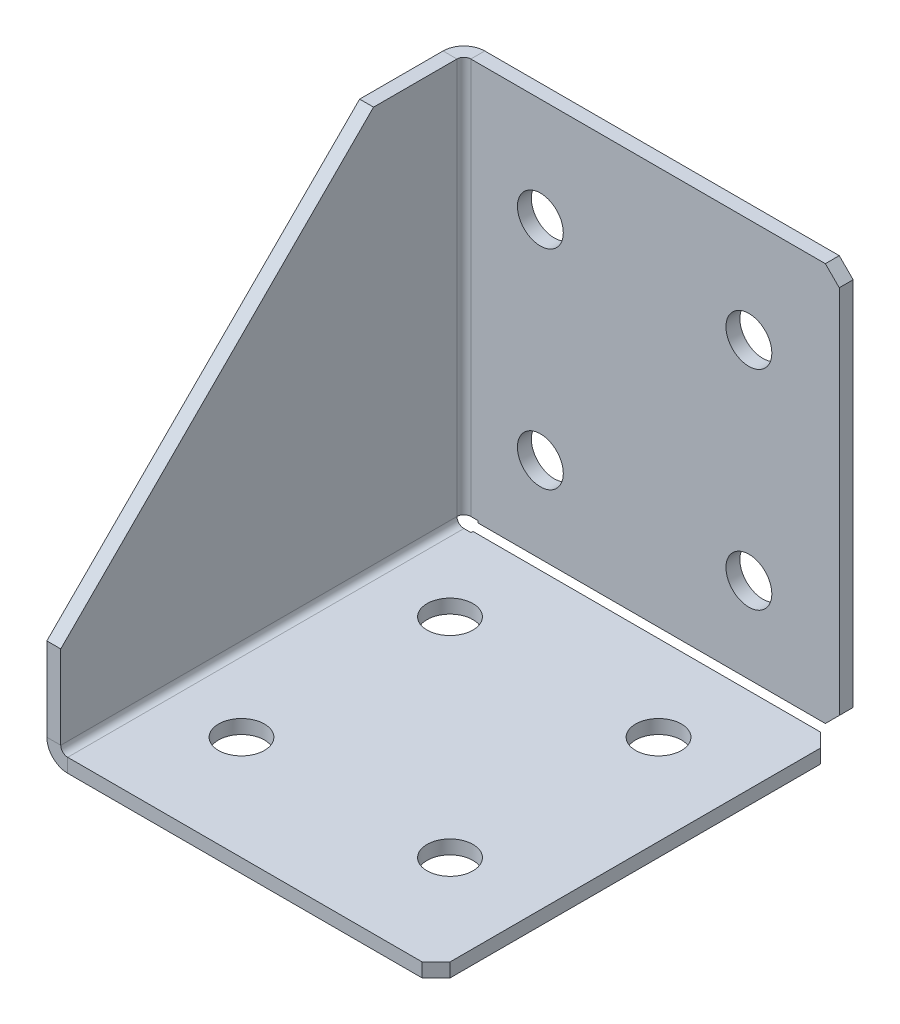
ISO-10303-21;
HEADER;
FILE_DESCRIPTION(('STEP AP214'),'2;1');
FILE_NAME('part.step','',(''),(''),'','','');
FILE_SCHEMA(('AUTOMOTIVE_DESIGN { 1 0 10303 214 1 1 1 1 }'));
ENDSEC;
DATA;
#1=APPLICATION_CONTEXT('core data for automotive mechanical design processes');
#2=APPLICATION_PROTOCOL_DEFINITION('international standard','automotive_design',2000,#1);
#3=PRODUCT_CONTEXT('',#1,'mechanical');
#4=PRODUCT('Part','Part','',(#3));
#5=PRODUCT_RELATED_PRODUCT_CATEGORY('part','',(#4));
#6=PRODUCT_DEFINITION_FORMATION('','',#4);
#7=PRODUCT_DEFINITION_CONTEXT('part definition',#1,'design');
#8=PRODUCT_DEFINITION('design','',#6,#7);
#9=PRODUCT_DEFINITION_SHAPE('','',#8);
#10=(LENGTH_UNIT() NAMED_UNIT(*) SI_UNIT(.MILLI.,.METRE.));
#11=(NAMED_UNIT(*) PLANE_ANGLE_UNIT() SI_UNIT($,.RADIAN.));
#12=(NAMED_UNIT(*) SI_UNIT($,.STERADIAN.) SOLID_ANGLE_UNIT());
#13=UNCERTAINTY_MEASURE_WITH_UNIT(LENGTH_MEASURE(1.E-05),#10,'distance_accuracy_value','');
#14=(GEOMETRIC_REPRESENTATION_CONTEXT(3) GLOBAL_UNCERTAINTY_ASSIGNED_CONTEXT((#13)) GLOBAL_UNIT_ASSIGNED_CONTEXT((#10,
#11,#12)) REPRESENTATION_CONTEXT('',''));
#15=CARTESIAN_POINT('',(0.,0.,0.));
#16=DIRECTION('',(0.,0.,1.));
#17=DIRECTION('',(1.,0.,0.));
#18=AXIS2_PLACEMENT_3D('',#15,#16,#17);
#19=CARTESIAN_POINT('',(-28.,2.,60.));
#20=DIRECTION('',(0.,-1.,0.));
#21=DIRECTION('',(0.,0.,-1.));
#22=AXIS2_PLACEMENT_3D('',#19,#20,#21);
#23=PLANE('',#22);
#24=DIRECTION('',(1.,0.,0.));
#25=VECTOR('',#24,1.);
#26=CARTESIAN_POINT('',(-28.,2.,60.));
#27=LINE('',#26,#25);
#28=CARTESIAN_POINT('',(-25.,2.,60.));
#29=VERTEX_POINT('',#28);
#30=CARTESIAN_POINT('',(26.,2.,60.));
#31=VERTEX_POINT('',#30);
#32=EDGE_CURVE('E348',#29,#31,#27,.T.);
#33=ORIENTED_EDGE('',*,*,#32,.T.);
#34=DIRECTION('',(-0.70710678118655,0.,0.707106781186545));
#35=VECTOR('',#34,1.);
#36=CARTESIAN_POINT('',(28.,2.,58.));
#37=LINE('',#36,#35);
#38=CARTESIAN_POINT('',(28.,2.,58.));
#39=VERTEX_POINT('',#38);
#40=EDGE_CURVE('E429',#31,#39,#37,.F.);
#41=ORIENTED_EDGE('',*,*,#40,.T.);
#42=DIRECTION('',(0.,0.,-1.));
#43=VECTOR('',#42,1.);
#44=CARTESIAN_POINT('',(28.,2.,60.));
#45=LINE('',#44,#43);
#46=CARTESIAN_POINT('',(28.,2.,4.70710678118655));
#47=VERTEX_POINT('',#46);
#48=EDGE_CURVE('E356',#39,#47,#45,.T.);
#49=ORIENTED_EDGE('',*,*,#48,.T.);
#50=DIRECTION('',(-0.707106781186545,0.,-0.70710678118655));
#51=VECTOR('',#50,1.);
#52=CARTESIAN_POINT('',(26.,2.,2.70710678118655));
#53=LINE('',#52,#51);
#54=CARTESIAN_POINT('',(26.,2.,2.70710678118655));
#55=VERTEX_POINT('',#54);
#56=EDGE_CURVE('E426',#47,#55,#53,.T.);
#57=ORIENTED_EDGE('',*,*,#56,.T.);
#58=DIRECTION('',(1.,0.,0.));
#59=VECTOR('',#58,1.);
#60=CARTESIAN_POINT('',(-28.,2.,2.70710678118655));
#61=LINE('',#60,#59);
#62=CARTESIAN_POINT('',(-23.989699,2.,2.70710678118655));
#63=VERTEX_POINT('',#62);
#64=EDGE_CURVE('E326',#63,#55,#61,.T.);
#65=ORIENTED_EDGE('',*,*,#64,.F.);
#66=DIRECTION('',(0.,0.,-1.));
#67=VECTOR('',#66,1.);
#68=CARTESIAN_POINT('',(-23.989699,2.,60.));
#69=LINE('',#68,#67);
#70=CARTESIAN_POINT('',(-23.989699,2.,2.99999999999998));
#71=VERTEX_POINT('',#70);
#72=EDGE_CURVE('E325',#71,#63,#69,.T.);
#73=ORIENTED_EDGE('',*,*,#72,.F.);
#74=DIRECTION('',(1.,0.,0.));
#75=VECTOR('',#74,1.);
#76=CARTESIAN_POINT('',(-28.,2.,2.99999999999998));
#77=LINE('',#76,#75);
#78=CARTESIAN_POINT('',(-25.,2.,2.99999999999998));
#79=VERTEX_POINT('',#78);
#80=EDGE_CURVE('E321',#71,#79,#77,.F.);
#81=ORIENTED_EDGE('',*,*,#80,.T.);
#82=DIRECTION('',(0.,0.,-1.));
#83=VECTOR('',#82,1.);
#84=CARTESIAN_POINT('',(-25.,2.,60.));
#85=LINE('',#84,#83);
#86=EDGE_CURVE('E307',#29,#79,#85,.T.);
#87=ORIENTED_EDGE('',*,*,#86,.F.);
#88=EDGE_LOOP('',(#33,#41,#49,#57,#65,#73,#81,#87));
#89=FACE_BOUND('',#88,.T.);
#90=CARTESIAN_POINT('',(15.,2.,15.));
#91=DIRECTION('',(0.,1.,0.));
#92=DIRECTION('',(0.,0.,1.));
#93=AXIS2_PLACEMENT_3D('',#90,#91,#92);
#94=CIRCLE('',#93,3.3);
#95=CARTESIAN_POINT('',(15.,2.,18.3));
#96=VERTEX_POINT('',#95);
#97=EDGE_CURVE('E663',#96,#96,#94,.T.);
#98=ORIENTED_EDGE('',*,*,#97,.F.);
#99=EDGE_LOOP('',(#98));
#100=FACE_BOUND('',#99,.T.);
#101=CARTESIAN_POINT('',(-15.,2.,45.));
#102=DIRECTION('',(0.,1.,0.));
#103=DIRECTION('',(0.,0.,1.));
#104=AXIS2_PLACEMENT_3D('',#101,#102,#103);
#105=CIRCLE('',#104,3.3);
#106=CARTESIAN_POINT('',(-15.,2.,48.3));
#107=VERTEX_POINT('',#106);
#108=EDGE_CURVE('E671',#107,#107,#105,.T.);
#109=ORIENTED_EDGE('',*,*,#108,.F.);
#110=EDGE_LOOP('',(#109));
#111=FACE_BOUND('',#110,.T.);
#112=CARTESIAN_POINT('',(15.,2.,45.));
#113=DIRECTION('',(0.,1.,0.));
#114=DIRECTION('',(0.,0.,1.));
#115=AXIS2_PLACEMENT_3D('',#112,#113,#114);
#116=CIRCLE('',#115,3.3);
#117=CARTESIAN_POINT('',(15.,2.,48.3));
#118=VERTEX_POINT('',#117);
#119=EDGE_CURVE('E679',#118,#118,#116,.T.);
#120=ORIENTED_EDGE('',*,*,#119,.F.);
#121=EDGE_LOOP('',(#120));
#122=FACE_BOUND('',#121,.T.);
#123=CARTESIAN_POINT('',(-15.,2.,15.));
#124=DIRECTION('',(0.,1.,0.));
#125=DIRECTION('',(0.,0.,1.));
#126=AXIS2_PLACEMENT_3D('',#123,#124,#125);
#127=CIRCLE('',#126,3.3);
#128=CARTESIAN_POINT('',(-15.,2.,18.3));
#129=VERTEX_POINT('',#128);
#130=EDGE_CURVE('E687',#129,#129,#127,.T.);
#131=ORIENTED_EDGE('',*,*,#130,.F.);
#132=EDGE_LOOP('',(#131));
#133=FACE_BOUND('',#132,.T.);
#134=ADVANCED_FACE('F50',(#89,#100,#111,#122,#133),#23,.F.);
#135=CARTESIAN_POINT('',(-28.,0.,2.));
#136=DIRECTION('',(0.,0.,-1.));
#137=DIRECTION('',(-1.,0.,0.));
#138=AXIS2_PLACEMENT_3D('',#135,#136,#137);
#139=PLANE('',#138);
#140=DIRECTION('',(-1.,0.,0.));
#141=VECTOR('',#140,1.);
#142=CARTESIAN_POINT('',(-28.,2.70710678118655,2.));
#143=LINE('',#142,#141);
#144=CARTESIAN_POINT('',(26.,2.70710678118655,2.));
#145=VERTEX_POINT('',#144);
#146=CARTESIAN_POINT('',(-23.989699,2.70710678118655,2.));
#147=VERTEX_POINT('',#146);
#148=EDGE_CURVE('E322',#145,#147,#143,.T.);
#149=ORIENTED_EDGE('',*,*,#148,.F.);
#150=DIRECTION('',(0.70710678118655,0.707106781186545,0.));
#151=VECTOR('',#150,1.);
#152=CARTESIAN_POINT('',(28.,4.70710678118655,2.));
#153=LINE('',#152,#151);
#154=CARTESIAN_POINT('',(28.,4.70710678118655,2.));
#155=VERTEX_POINT('',#154);
#156=EDGE_CURVE('E60',#145,#155,#153,.T.);
#157=ORIENTED_EDGE('',*,*,#156,.T.);
#158=DIRECTION('',(0.,1.,0.));
#159=VECTOR('',#158,1.);
#160=CARTESIAN_POINT('',(28.,0.,2.));
#161=LINE('',#160,#159);
#162=CARTESIAN_POINT('',(28.,58.,2.));
#163=VERTEX_POINT('',#162);
#164=EDGE_CURVE('E327',#155,#163,#161,.T.);
#165=ORIENTED_EDGE('',*,*,#164,.T.);
#166=DIRECTION('',(-0.707106781186545,0.70710678118655,0.));
#167=VECTOR('',#166,1.);
#168=CARTESIAN_POINT('',(26.,60.,2.));
#169=LINE('',#168,#167);
#170=CARTESIAN_POINT('',(26.,60.,2.));
#171=VERTEX_POINT('',#170);
#172=EDGE_CURVE('E67',#163,#171,#169,.T.);
#173=ORIENTED_EDGE('',*,*,#172,.T.);
#174=DIRECTION('',(-1.,0.,0.));
#175=VECTOR('',#174,1.);
#176=CARTESIAN_POINT('',(-28.,60.,2.));
#177=LINE('',#176,#175);
#178=CARTESIAN_POINT('',(-25.,60.,2.));
#179=VERTEX_POINT('',#178);
#180=EDGE_CURVE('E330',#179,#171,#177,.F.);
#181=ORIENTED_EDGE('',*,*,#180,.F.);
#182=DIRECTION('',(0.,1.,0.));
#183=VECTOR('',#182,1.);
#184=CARTESIAN_POINT('',(-25.,0.,2.));
#185=LINE('',#184,#183);
#186=CARTESIAN_POINT('',(-25.,2.99999999999998,2.));
#187=VERTEX_POINT('',#186);
#188=EDGE_CURVE('E298',#187,#179,#185,.T.);
#189=ORIENTED_EDGE('',*,*,#188,.F.);
#190=DIRECTION('',(-1.,0.,0.));
#191=VECTOR('',#190,1.);
#192=CARTESIAN_POINT('',(-28.,2.99999999999998,2.));
#193=LINE('',#192,#191);
#194=CARTESIAN_POINT('',(-23.989699,2.99999999999998,2.));
#195=VERTEX_POINT('',#194);
#196=EDGE_CURVE('E303',#187,#195,#193,.F.);
#197=ORIENTED_EDGE('',*,*,#196,.T.);
#198=DIRECTION('',(0.,1.,0.));
#199=VECTOR('',#198,1.);
#200=CARTESIAN_POINT('',(-23.989699,0.,2.));
#201=LINE('',#200,#199);
#202=EDGE_CURVE('E317',#147,#195,#201,.T.);
#203=ORIENTED_EDGE('',*,*,#202,.F.);
#204=EDGE_LOOP('',(#149,#157,#165,#173,#181,#189,#197,#203));
#205=FACE_BOUND('',#204,.T.);
#206=CARTESIAN_POINT('',(15.,15.,2.));
#207=DIRECTION('',(0.,0.,1.));
#208=DIRECTION('',(1.,0.,0.));
#209=AXIS2_PLACEMENT_3D('',#206,#207,#208);
#210=CIRCLE('',#209,3.3);
#211=CARTESIAN_POINT('',(18.3,15.,2.));
#212=VERTEX_POINT('',#211);
#213=EDGE_CURVE('E631',#212,#212,#210,.T.);
#214=ORIENTED_EDGE('',*,*,#213,.F.);
#215=EDGE_LOOP('',(#214));
#216=FACE_BOUND('',#215,.T.);
#217=CARTESIAN_POINT('',(-15.,45.,2.));
#218=DIRECTION('',(0.,0.,1.));
#219=DIRECTION('',(1.,0.,0.));
#220=AXIS2_PLACEMENT_3D('',#217,#218,#219);
#221=CIRCLE('',#220,3.3);
#222=CARTESIAN_POINT('',(-11.7,45.,2.));
#223=VERTEX_POINT('',#222);
#224=EDGE_CURVE('E639',#223,#223,#221,.T.);
#225=ORIENTED_EDGE('',*,*,#224,.F.);
#226=EDGE_LOOP('',(#225));
#227=FACE_BOUND('',#226,.T.);
#228=CARTESIAN_POINT('',(15.,45.,2.));
#229=DIRECTION('',(0.,0.,1.));
#230=DIRECTION('',(1.,0.,0.));
#231=AXIS2_PLACEMENT_3D('',#228,#229,#230);
#232=CIRCLE('',#231,3.3);
#233=CARTESIAN_POINT('',(18.3,45.,2.));
#234=VERTEX_POINT('',#233);
#235=EDGE_CURVE('E647',#234,#234,#232,.T.);
#236=ORIENTED_EDGE('',*,*,#235,.F.);
#237=EDGE_LOOP('',(#236));
#238=FACE_BOUND('',#237,.T.);
#239=CARTESIAN_POINT('',(-15.,15.,2.));
#240=DIRECTION('',(0.,0.,1.));
#241=DIRECTION('',(1.,0.,0.));
#242=AXIS2_PLACEMENT_3D('',#239,#240,#241);
#243=CIRCLE('',#242,3.3);
#244=CARTESIAN_POINT('',(-11.7,15.,2.));
#245=VERTEX_POINT('',#244);
#246=EDGE_CURVE('E655',#245,#245,#243,.T.);
#247=ORIENTED_EDGE('',*,*,#246,.F.);
#248=EDGE_LOOP('',(#247));
#249=FACE_BOUND('',#248,.T.);
#250=ADVANCED_FACE('F457',(#205,#216,#227,#238,#249),#139,.F.);
#251=CARTESIAN_POINT('',(-25.,3.,2.99999999999998));
#252=DIRECTION('',(0.,0.,-1.));
#253=DIRECTION('',(-1.,0.,0.));
#254=AXIS2_PLACEMENT_3D('',#251,#252,#253);
#255=PLANE('',#254);
#256=DIRECTION('',(-1.,0.,0.));
#257=VECTOR('',#256,1.);
#258=CARTESIAN_POINT('',(-28.,2.99999999999998,2.99999999999998));
#259=LINE('',#258,#257);
#260=CARTESIAN_POINT('',(-26.,2.99999999999998,2.99999999999999));
#261=VERTEX_POINT('',#260);
#262=CARTESIAN_POINT('',(-28.,2.99999999999998,2.99999999999998));
#263=VERTEX_POINT('',#262);
#264=EDGE_CURVE('E405',#261,#263,#259,.T.);
#265=ORIENTED_EDGE('',*,*,#264,.F.);
#266=CARTESIAN_POINT('',(-25.,3.,2.99999999999998));
#267=DIRECTION('',(0.,0.,1.));
#268=DIRECTION('',(1.,0.,0.));
#269=AXIS2_PLACEMENT_3D('',#266,#267,#268);
#270=CIRCLE('',#269,1.);
#271=EDGE_CURVE('E352',#261,#79,#270,.T.);
#272=ORIENTED_EDGE('',*,*,#271,.T.);
#273=DIRECTION('',(0.,-1.,0.));
#274=VECTOR('',#273,1.);
#275=CARTESIAN_POINT('',(-25.,0.,2.99999999999998));
#276=LINE('',#275,#274);
#277=CARTESIAN_POINT('',(-25.,0.,2.99999999999998));
#278=VERTEX_POINT('',#277);
#279=EDGE_CURVE('E402',#79,#278,#276,.T.);
#280=ORIENTED_EDGE('',*,*,#279,.T.);
#281=CARTESIAN_POINT('',(-25.,3.,2.99999999999998));
#282=DIRECTION('',(0.,0.,1.));
#283=DIRECTION('',(1.,0.,0.));
#284=AXIS2_PLACEMENT_3D('',#281,#282,#283);
#285=CIRCLE('',#284,3.);
#286=EDGE_CURVE('E290',#263,#278,#285,.T.);
#287=ORIENTED_EDGE('',*,*,#286,.F.);
#288=EDGE_LOOP('',(#265,#272,#280,#287));
#289=FACE_BOUND('',#288,.T.);
#290=ADVANCED_FACE('F488',(#289),#255,.T.);
#291=CARTESIAN_POINT('',(-28.,0.,2.99999999999998));
#292=DIRECTION('',(0.,0.,1.));
#293=DIRECTION('',(-1.,0.,0.));
#294=AXIS2_PLACEMENT_3D('',#291,#292,#293);
#295=PLANE('',#294);
#296=ORIENTED_EDGE('',*,*,#279,.F.);
#297=ORIENTED_EDGE('',*,*,#80,.F.);
#298=DIRECTION('',(0.,-1.,0.));
#299=VECTOR('',#298,1.);
#300=CARTESIAN_POINT('',(-23.989699,0.,2.99999999999998));
#301=LINE('',#300,#299);
#302=CARTESIAN_POINT('',(-23.989699,0.,2.99999999999998));
#303=VERTEX_POINT('',#302);
#304=EDGE_CURVE('E399',#71,#303,#301,.T.);
#305=ORIENTED_EDGE('',*,*,#304,.T.);
#306=DIRECTION('',(-1.,0.,0.));
#307=VECTOR('',#306,1.);
#308=CARTESIAN_POINT('',(-28.,0.,2.99999999999998));
#309=LINE('',#308,#307);
#310=EDGE_CURVE('E254',#303,#278,#309,.T.);
#311=ORIENTED_EDGE('',*,*,#310,.T.);
#312=EDGE_LOOP('',(#296,#297,#305,#311));
#313=FACE_BOUND('',#312,.T.);
#314=ADVANCED_FACE('F574',(#313),#295,.F.);
#315=CARTESIAN_POINT('',(-23.989699,0.,60.));
#316=DIRECTION('',(-1.,0.,0.));
#317=DIRECTION('',(0.,0.,-1.));
#318=AXIS2_PLACEMENT_3D('',#315,#316,#317);
#319=PLANE('',#318);
#320=ORIENTED_EDGE('',*,*,#304,.F.);
#321=ORIENTED_EDGE('',*,*,#72,.T.);
#322=DIRECTION('',(0.,-1.,0.));
#323=VECTOR('',#322,1.);
#324=CARTESIAN_POINT('',(-23.989699,0.,2.70710678118655));
#325=LINE('',#324,#323);
#326=CARTESIAN_POINT('',(-23.989699,0.,2.70710678118655));
#327=VERTEX_POINT('',#326);
#328=EDGE_CURVE('E396',#63,#327,#325,.T.);
#329=ORIENTED_EDGE('',*,*,#328,.T.);
#330=DIRECTION('',(0.,0.,-1.));
#331=VECTOR('',#330,1.);
#332=CARTESIAN_POINT('',(-23.989699,0.,60.));
#333=LINE('',#332,#331);
#334=EDGE_CURVE('E250',#303,#327,#333,.T.);
#335=ORIENTED_EDGE('',*,*,#334,.F.);
#336=EDGE_LOOP('',(#320,#321,#329,#335));
#337=FACE_BOUND('',#336,.T.);
#338=ADVANCED_FACE('F570',(#337),#319,.T.);
#339=CARTESIAN_POINT('',(-28.,0.,2.70710678118655));
#340=DIRECTION('',(0.,0.,-1.));
#341=DIRECTION('',(1.,0.,0.));
#342=AXIS2_PLACEMENT_3D('',#339,#340,#341);
#343=PLANE('',#342);
#344=ORIENTED_EDGE('',*,*,#64,.T.);
#345=DIRECTION('',(0.,-1.,0.));
#346=VECTOR('',#345,1.);
#347=CARTESIAN_POINT('',(26.,0.,2.70710678118655));
#348=LINE('',#347,#346);
#349=CARTESIAN_POINT('',(26.,0.,2.70710678118655));
#350=VERTEX_POINT('',#349);
#351=EDGE_CURVE('E432',#55,#350,#348,.T.);
#352=ORIENTED_EDGE('',*,*,#351,.T.);
#353=DIRECTION('',(1.,0.,0.));
#354=VECTOR('',#353,1.);
#355=CARTESIAN_POINT('',(-28.,0.,2.70710678118655));
#356=LINE('',#355,#354);
#357=EDGE_CURVE('E243',#327,#350,#356,.T.);
#358=ORIENTED_EDGE('',*,*,#357,.F.);
#359=ORIENTED_EDGE('',*,*,#328,.F.);
#360=EDGE_LOOP('',(#344,#352,#358,#359));
#361=FACE_BOUND('',#360,.T.);
#362=ADVANCED_FACE('F566',(#361),#343,.T.);
#363=CARTESIAN_POINT('',(28.,0.,60.));
#364=DIRECTION('',(-1.,0.,0.));
#365=DIRECTION('',(0.,0.,-1.));
#366=AXIS2_PLACEMENT_3D('',#363,#364,#365);
#367=PLANE('',#366);
#368=ORIENTED_EDGE('',*,*,#48,.F.);
#369=DIRECTION('',(0.,1.,0.));
#370=VECTOR('',#369,1.);
#371=CARTESIAN_POINT('',(28.,0.,58.));
#372=LINE('',#371,#370);
#373=CARTESIAN_POINT('',(28.,0.,58.));
#374=VERTEX_POINT('',#373);
#375=EDGE_CURVE('E413',#39,#374,#372,.F.);
#376=ORIENTED_EDGE('',*,*,#375,.T.);
#377=DIRECTION('',(0.,0.,-1.));
#378=VECTOR('',#377,1.);
#379=CARTESIAN_POINT('',(28.,0.,60.));
#380=LINE('',#379,#378);
#381=CARTESIAN_POINT('',(28.,0.,4.70710678118655));
#382=VERTEX_POINT('',#381);
#383=EDGE_CURVE('E283',#374,#382,#380,.T.);
#384=ORIENTED_EDGE('',*,*,#383,.T.);
#385=DIRECTION('',(0.,-1.,0.));
#386=VECTOR('',#385,1.);
#387=CARTESIAN_POINT('',(28.,0.,4.70710678118655));
#388=LINE('',#387,#386);
#389=EDGE_CURVE('E408',#382,#47,#388,.F.);
#390=ORIENTED_EDGE('',*,*,#389,.T.);
#391=EDGE_LOOP('',(#368,#376,#384,#390));
#392=FACE_BOUND('',#391,.T.);
#393=ADVANCED_FACE('F562',(#392),#367,.F.);
#394=CARTESIAN_POINT('',(-28.,0.,60.));
#395=DIRECTION('',(0.,0.,-1.));
#396=DIRECTION('',(1.,0.,0.));
#397=AXIS2_PLACEMENT_3D('',#394,#395,#396);
#398=PLANE('',#397);
#399=DIRECTION('',(1.,0.,0.));
#400=VECTOR('',#399,1.);
#401=CARTESIAN_POINT('',(-28.,0.,60.));
#402=LINE('',#401,#400);
#403=CARTESIAN_POINT('',(-25.,0.,60.));
#404=VERTEX_POINT('',#403);
#405=CARTESIAN_POINT('',(26.,0.,60.));
#406=VERTEX_POINT('',#405);
#407=EDGE_CURVE('E223',#404,#406,#402,.T.);
#408=ORIENTED_EDGE('',*,*,#407,.T.);
#409=DIRECTION('',(0.,-1.,0.));
#410=VECTOR('',#409,1.);
#411=CARTESIAN_POINT('',(26.,0.,60.));
#412=LINE('',#411,#410);
#413=EDGE_CURVE('E423',#406,#31,#412,.F.);
#414=ORIENTED_EDGE('',*,*,#413,.T.);
#415=ORIENTED_EDGE('',*,*,#32,.F.);
#416=DIRECTION('',(0.,-1.,0.));
#417=VECTOR('',#416,1.);
#418=CARTESIAN_POINT('',(-25.,0.,60.));
#419=LINE('',#418,#417);
#420=EDGE_CURVE('E393',#29,#404,#419,.T.);
#421=ORIENTED_EDGE('',*,*,#420,.T.);
#422=EDGE_LOOP('',(#408,#414,#415,#421));
#423=FACE_BOUND('',#422,.T.);
#424=ADVANCED_FACE('F559',(#423),#398,.F.);
#425=CARTESIAN_POINT('',(-25.,3.,60.));
#426=DIRECTION('',(0.,0.,-1.));
#427=DIRECTION('',(-1.,0.,0.));
#428=AXIS2_PLACEMENT_3D('',#425,#426,#427);
#429=PLANE('',#428);
#430=ORIENTED_EDGE('',*,*,#420,.F.);
#431=CARTESIAN_POINT('',(-25.,3.,60.));
#432=DIRECTION('',(0.,0.,1.));
#433=DIRECTION('',(1.,0.,0.));
#434=AXIS2_PLACEMENT_3D('',#431,#432,#433);
#435=CIRCLE('',#434,1.);
#436=CARTESIAN_POINT('',(-26.,3.,60.));
#437=VERTEX_POINT('',#436);
#438=EDGE_CURVE('E339',#29,#437,#435,.F.);
#439=ORIENTED_EDGE('',*,*,#438,.T.);
#440=DIRECTION('',(-1.,0.,0.));
#441=VECTOR('',#440,1.);
#442=CARTESIAN_POINT('',(-28.,3.,60.));
#443=LINE('',#442,#441);
#444=CARTESIAN_POINT('',(-28.,3.,60.));
#445=VERTEX_POINT('',#444);
#446=EDGE_CURVE('E210',#437,#445,#443,.T.);
#447=ORIENTED_EDGE('',*,*,#446,.T.);
#448=CARTESIAN_POINT('',(-25.,3.,60.));
#449=DIRECTION('',(0.,0.,1.));
#450=DIRECTION('',(1.,0.,0.));
#451=AXIS2_PLACEMENT_3D('',#448,#449,#450);
#452=CIRCLE('',#451,3.);
#453=EDGE_CURVE('E279',#404,#445,#452,.F.);
#454=ORIENTED_EDGE('',*,*,#453,.F.);
#455=EDGE_LOOP('',(#430,#439,#447,#454));
#456=FACE_BOUND('',#455,.T.);
#457=ADVANCED_FACE('F496',(#456),#429,.F.);
#458=CARTESIAN_POINT('',(-28.,15.,60.));
#459=DIRECTION('',(0.,0.,1.));
#460=DIRECTION('',(0.,-1.,0.));
#461=AXIS2_PLACEMENT_3D('',#458,#459,#460);
#462=PLANE('',#461);
#463=ORIENTED_EDGE('',*,*,#446,.F.);
#464=DIRECTION('',(0.,1.,0.));
#465=VECTOR('',#464,1.);
#466=CARTESIAN_POINT('',(-26.,0.,60.));
#467=LINE('',#466,#465);
#468=CARTESIAN_POINT('',(-26.,15.,60.));
#469=VERTEX_POINT('',#468);
#470=EDGE_CURVE('E204',#469,#437,#467,.F.);
#471=ORIENTED_EDGE('',*,*,#470,.F.);
#472=DIRECTION('',(-1.,0.,0.));
#473=VECTOR('',#472,1.);
#474=CARTESIAN_POINT('',(-28.,15.,60.));
#475=LINE('',#474,#473);
#476=CARTESIAN_POINT('',(-28.,15.,60.));
#477=VERTEX_POINT('',#476);
#478=EDGE_CURVE('E198',#469,#477,#475,.T.);
#479=ORIENTED_EDGE('',*,*,#478,.T.);
#480=DIRECTION('',(0.,-1.,0.));
#481=VECTOR('',#480,1.);
#482=CARTESIAN_POINT('',(-28.,15.,60.));
#483=LINE('',#482,#481);
#484=EDGE_CURVE('E201',#477,#445,#483,.T.);
#485=ORIENTED_EDGE('',*,*,#484,.T.);
#486=EDGE_LOOP('',(#463,#471,#479,#485));
#487=FACE_BOUND('',#486,.T.);
#488=ADVANCED_FACE('F200',(#487),#462,.T.);
#489=CARTESIAN_POINT('',(-28.,60.,15.));
#490=DIRECTION('',(0.,0.707106781186548,0.707106781186548));
#491=DIRECTION('',(0.,-0.707106781186548,0.707106781186548));
#492=AXIS2_PLACEMENT_3D('',#489,#490,#491);
#493=PLANE('',#492);
#494=ORIENTED_EDGE('',*,*,#478,.F.);
#495=DIRECTION('',(0.,-0.707106781186548,0.707106781186548));
#496=VECTOR('',#495,1.);
#497=CARTESIAN_POINT('',(-26.,60.,15.));
#498=LINE('',#497,#496);
#499=CARTESIAN_POINT('',(-26.,60.,15.));
#500=VERTEX_POINT('',#499);
#501=EDGE_CURVE('E343',#500,#469,#498,.T.);
#502=ORIENTED_EDGE('',*,*,#501,.F.);
#503=DIRECTION('',(-1.,0.,0.));
#504=VECTOR('',#503,1.);
#505=CARTESIAN_POINT('',(-28.,60.,15.));
#506=LINE('',#505,#504);
#507=CARTESIAN_POINT('',(-28.,60.,15.));
#508=VERTEX_POINT('',#507);
#509=EDGE_CURVE('E211',#500,#508,#506,.T.);
#510=ORIENTED_EDGE('',*,*,#509,.T.);
#511=DIRECTION('',(0.,-0.707106781186548,0.707106781186548));
#512=VECTOR('',#511,1.);
#513=CARTESIAN_POINT('',(-28.,60.,15.));
#514=LINE('',#513,#512);
#515=EDGE_CURVE('E218',#508,#477,#514,.T.);
#516=ORIENTED_EDGE('',*,*,#515,.T.);
#517=EDGE_LOOP('',(#494,#502,#510,#516));
#518=FACE_BOUND('',#517,.T.);
#519=ADVANCED_FACE('F225',(#518),#493,.T.);
#520=CARTESIAN_POINT('',(-28.,60.,0.));
#521=DIRECTION('',(0.,1.,0.));
#522=DIRECTION('',(0.,0.,1.));
#523=AXIS2_PLACEMENT_3D('',#520,#521,#522);
#524=PLANE('',#523);
#525=ORIENTED_EDGE('',*,*,#509,.F.);
#526=DIRECTION('',(0.,0.,-1.));
#527=VECTOR('',#526,1.);
#528=CARTESIAN_POINT('',(-26.,60.,0.));
#529=LINE('',#528,#527);
#530=CARTESIAN_POINT('',(-26.,60.,3.));
#531=VERTEX_POINT('',#530);
#532=EDGE_CURVE('E333',#531,#500,#529,.F.);
#533=ORIENTED_EDGE('',*,*,#532,.F.);
#534=DIRECTION('',(-1.,0.,0.));
#535=VECTOR('',#534,1.);
#536=CARTESIAN_POINT('',(-28.,60.,3.));
#537=LINE('',#536,#535);
#538=CARTESIAN_POINT('',(-28.,60.,3.));
#539=VERTEX_POINT('',#538);
#540=EDGE_CURVE('E386',#531,#539,#537,.T.);
#541=ORIENTED_EDGE('',*,*,#540,.T.);
#542=DIRECTION('',(0.,0.,1.));
#543=VECTOR('',#542,1.);
#544=CARTESIAN_POINT('',(-28.,60.,0.));
#545=LINE('',#544,#543);
#546=EDGE_CURVE('E227',#539,#508,#545,.T.);
#547=ORIENTED_EDGE('',*,*,#546,.T.);
#548=EDGE_LOOP('',(#525,#533,#541,#547));
#549=FACE_BOUND('',#548,.T.);
#550=ADVANCED_FACE('F509',(#549),#524,.T.);
#551=CARTESIAN_POINT('',(-25.,60.,3.));
#552=DIRECTION('',(0.,1.,0.));
#553=DIRECTION('',(0.,0.,1.));
#554=AXIS2_PLACEMENT_3D('',#551,#552,#553);
#555=PLANE('',#554);
#556=ORIENTED_EDGE('',*,*,#540,.F.);
#557=CARTESIAN_POINT('',(-25.,60.,3.));
#558=DIRECTION('',(0.,-1.,0.));
#559=DIRECTION('',(0.,0.,-1.));
#560=AXIS2_PLACEMENT_3D('',#557,#558,#559);
#561=CIRCLE('',#560,1.);
#562=EDGE_CURVE('E334',#531,#179,#561,.T.);
#563=ORIENTED_EDGE('',*,*,#562,.T.);
#564=DIRECTION('',(0.,0.,-1.));
#565=VECTOR('',#564,1.);
#566=CARTESIAN_POINT('',(-25.,60.,0.));
#567=LINE('',#566,#565);
#568=CARTESIAN_POINT('',(-25.,60.,0.));
#569=VERTEX_POINT('',#568);
#570=EDGE_CURVE('E383',#179,#569,#567,.T.);
#571=ORIENTED_EDGE('',*,*,#570,.T.);
#572=CARTESIAN_POINT('',(-25.,60.,3.));
#573=DIRECTION('',(0.,-1.,0.));
#574=DIRECTION('',(0.,0.,-1.));
#575=AXIS2_PLACEMENT_3D('',#572,#573,#574);
#576=CIRCLE('',#575,3.);
#577=EDGE_CURVE('E274',#539,#569,#576,.T.);
#578=ORIENTED_EDGE('',*,*,#577,.F.);
#579=EDGE_LOOP('',(#556,#563,#571,#578));
#580=FACE_BOUND('',#579,.T.);
#581=ADVANCED_FACE('F511',(#580),#555,.T.);
#582=CARTESIAN_POINT('',(-28.,60.,0.));
#583=DIRECTION('',(0.,1.,0.));
#584=DIRECTION('',(1.,0.,0.));
#585=AXIS2_PLACEMENT_3D('',#582,#583,#584);
#586=PLANE('',#585);
#587=ORIENTED_EDGE('',*,*,#180,.T.);
#588=DIRECTION('',(0.,0.,-1.));
#589=VECTOR('',#588,1.);
#590=CARTESIAN_POINT('',(26.,60.,0.));
#591=LINE('',#590,#589);
#592=CARTESIAN_POINT('',(26.,60.,0.));
#593=VERTEX_POINT('',#592);
#594=EDGE_CURVE('E11',#171,#593,#591,.T.);
#595=ORIENTED_EDGE('',*,*,#594,.T.);
#596=DIRECTION('',(1.,0.,0.));
#597=VECTOR('',#596,1.);
#598=CARTESIAN_POINT('',(-28.,60.,0.));
#599=LINE('',#598,#597);
#600=EDGE_CURVE('E232',#569,#593,#599,.T.);
#601=ORIENTED_EDGE('',*,*,#600,.F.);
#602=ORIENTED_EDGE('',*,*,#570,.F.);
#603=EDGE_LOOP('',(#587,#595,#601,#602));
#604=FACE_BOUND('',#603,.T.);
#605=ADVANCED_FACE('F514',(#604),#586,.T.);
#606=CARTESIAN_POINT('',(28.,0.,0.));
#607=DIRECTION('',(-1.,0.,0.));
#608=DIRECTION('',(0.,1.,0.));
#609=AXIS2_PLACEMENT_3D('',#606,#607,#608);
#610=PLANE('',#609);
#611=ORIENTED_EDGE('',*,*,#164,.F.);
#612=DIRECTION('',(0.,0.,1.));
#613=VECTOR('',#612,1.);
#614=CARTESIAN_POINT('',(28.,4.70710678118655,0.));
#615=LINE('',#614,#613);
#616=CARTESIAN_POINT('',(28.,4.70710678118655,0.));
#617=VERTEX_POINT('',#616);
#618=EDGE_CURVE('E439',#155,#617,#615,.F.);
#619=ORIENTED_EDGE('',*,*,#618,.T.);
#620=DIRECTION('',(0.,1.,0.));
#621=VECTOR('',#620,1.);
#622=CARTESIAN_POINT('',(28.,0.,0.));
#623=LINE('',#622,#621);
#624=CARTESIAN_POINT('',(28.,58.,0.));
#625=VERTEX_POINT('',#624);
#626=EDGE_CURVE('E239',#617,#625,#623,.T.);
#627=ORIENTED_EDGE('',*,*,#626,.T.);
#628=DIRECTION('',(0.,0.,-1.));
#629=VECTOR('',#628,1.);
#630=CARTESIAN_POINT('',(28.,58.,0.));
#631=LINE('',#630,#629);
#632=EDGE_CURVE('E436',#625,#163,#631,.F.);
#633=ORIENTED_EDGE('',*,*,#632,.T.);
#634=EDGE_LOOP('',(#611,#619,#627,#633));
#635=FACE_BOUND('',#634,.T.);
#636=ADVANCED_FACE('F463',(#635),#610,.F.);
#637=CARTESIAN_POINT('',(-28.,2.70710678118655,0.));
#638=DIRECTION('',(0.,-1.,0.));
#639=DIRECTION('',(-1.,0.,0.));
#640=AXIS2_PLACEMENT_3D('',#637,#638,#639);
#641=PLANE('',#640);
#642=DIRECTION('',(-1.,0.,0.));
#643=VECTOR('',#642,1.);
#644=CARTESIAN_POINT('',(-28.,2.70710678118655,0.));
#645=LINE('',#644,#643);
#646=CARTESIAN_POINT('',(26.,2.70710678118655,0.));
#647=VERTEX_POINT('',#646);
#648=CARTESIAN_POINT('',(-23.989699,2.70710678118655,0.));
#649=VERTEX_POINT('',#648);
#650=EDGE_CURVE('E247',#647,#649,#645,.T.);
#651=ORIENTED_EDGE('',*,*,#650,.F.);
#652=DIRECTION('',(0.,0.,1.));
#653=VECTOR('',#652,1.);
#654=CARTESIAN_POINT('',(26.,2.70710678118655,0.));
#655=LINE('',#654,#653);
#656=EDGE_CURVE('E75',#647,#145,#655,.T.);
#657=ORIENTED_EDGE('',*,*,#656,.T.);
#658=ORIENTED_EDGE('',*,*,#148,.T.);
#659=DIRECTION('',(0.,0.,-1.));
#660=VECTOR('',#659,1.);
#661=CARTESIAN_POINT('',(-23.989699,2.70710678118655,0.));
#662=LINE('',#661,#660);
#663=EDGE_CURVE('E379',#147,#649,#662,.T.);
#664=ORIENTED_EDGE('',*,*,#663,.T.);
#665=EDGE_LOOP('',(#651,#657,#658,#664));
#666=FACE_BOUND('',#665,.T.);
#667=ADVANCED_FACE('F469',(#666),#641,.T.);
#668=CARTESIAN_POINT('',(-23.989699,0.,0.));
#669=DIRECTION('',(-1.,0.,0.));
#670=DIRECTION('',(0.,1.,0.));
#671=AXIS2_PLACEMENT_3D('',#668,#669,#670);
#672=PLANE('',#671);
#673=ORIENTED_EDGE('',*,*,#663,.F.);
#674=ORIENTED_EDGE('',*,*,#202,.T.);
#675=DIRECTION('',(0.,0.,-1.));
#676=VECTOR('',#675,1.);
#677=CARTESIAN_POINT('',(-23.989699,2.99999999999998,0.));
#678=LINE('',#677,#676);
#679=CARTESIAN_POINT('',(-23.989699,2.99999999999998,0.));
#680=VERTEX_POINT('',#679);
#681=EDGE_CURVE('E376',#195,#680,#678,.T.);
#682=ORIENTED_EDGE('',*,*,#681,.T.);
#683=DIRECTION('',(0.,1.,0.));
#684=VECTOR('',#683,1.);
#685=CARTESIAN_POINT('',(-23.989699,0.,0.));
#686=LINE('',#685,#684);
#687=EDGE_CURVE('E258',#649,#680,#686,.T.);
#688=ORIENTED_EDGE('',*,*,#687,.F.);
#689=EDGE_LOOP('',(#673,#674,#682,#688));
#690=FACE_BOUND('',#689,.T.);
#691=ADVANCED_FACE('F473',(#690),#672,.T.);
#692=CARTESIAN_POINT('',(-28.,2.99999999999998,0.));
#693=DIRECTION('',(0.,1.,0.));
#694=DIRECTION('',(1.,0.,0.));
#695=AXIS2_PLACEMENT_3D('',#692,#693,#694);
#696=PLANE('',#695);
#697=ORIENTED_EDGE('',*,*,#681,.F.);
#698=ORIENTED_EDGE('',*,*,#196,.F.);
#699=DIRECTION('',(0.,0.,-1.));
#700=VECTOR('',#699,1.);
#701=CARTESIAN_POINT('',(-25.,2.99999999999998,0.));
#702=LINE('',#701,#700);
#703=CARTESIAN_POINT('',(-25.,2.99999999999998,0.));
#704=VERTEX_POINT('',#703);
#705=EDGE_CURVE('E289',#187,#704,#702,.T.);
#706=ORIENTED_EDGE('',*,*,#705,.T.);
#707=DIRECTION('',(1.,0.,0.));
#708=VECTOR('',#707,1.);
#709=CARTESIAN_POINT('',(-28.,2.99999999999998,0.));
#710=LINE('',#709,#708);
#711=EDGE_CURVE('E262',#704,#680,#710,.T.);
#712=ORIENTED_EDGE('',*,*,#711,.T.);
#713=EDGE_LOOP('',(#697,#698,#706,#712));
#714=FACE_BOUND('',#713,.T.);
#715=ADVANCED_FACE('F477',(#714),#696,.F.);
#716=CARTESIAN_POINT('',(-25.,2.99999999999998,3.));
#717=DIRECTION('',(0.,-1.,0.));
#718=DIRECTION('',(0.,0.,-1.));
#719=AXIS2_PLACEMENT_3D('',#716,#717,#718);
#720=PLANE('',#719);
#721=CARTESIAN_POINT('',(-25.,2.99999999999998,3.));
#722=DIRECTION('',(0.,-1.,0.));
#723=DIRECTION('',(0.,0.,-1.));
#724=AXIS2_PLACEMENT_3D('',#721,#722,#723);
#725=CIRCLE('',#724,1.);
#726=EDGE_CURVE('E338',#187,#261,#725,.F.);
#727=ORIENTED_EDGE('',*,*,#726,.T.);
#728=ORIENTED_EDGE('',*,*,#264,.T.);
#729=CARTESIAN_POINT('',(-25.,2.99999999999998,3.));
#730=DIRECTION('',(0.,1.,0.));
#731=DIRECTION('',(0.,0.,1.));
#732=AXIS2_PLACEMENT_3D('',#729,#730,#731);
#733=CIRCLE('',#732,3.);
#734=EDGE_CURVE('E278',#704,#263,#733,.T.);
#735=ORIENTED_EDGE('',*,*,#734,.F.);
#736=ORIENTED_EDGE('',*,*,#705,.F.);
#737=EDGE_LOOP('',(#727,#728,#735,#736));
#738=FACE_BOUND('',#737,.T.);
#739=ADVANCED_FACE('F482',(#738),#720,.T.);
#740=CARTESIAN_POINT('',(-28.,0.,0.));
#741=DIRECTION('',(0.,0.,-1.));
#742=DIRECTION('',(-1.,0.,0.));
#743=AXIS2_PLACEMENT_3D('',#740,#741,#742);
#744=PLANE('',#743);
#745=CARTESIAN_POINT('',(-15.,15.,0.));
#746=DIRECTION('',(0.,0.,-1.));
#747=DIRECTION('',(-1.,0.,0.));
#748=AXIS2_PLACEMENT_3D('',#745,#746,#747);
#749=CIRCLE('',#748,3.3);
#750=CARTESIAN_POINT('',(-18.3,15.,0.));
#751=VERTEX_POINT('',#750);
#752=EDGE_CURVE('E651',#751,#751,#749,.T.);
#753=ORIENTED_EDGE('',*,*,#752,.F.);
#754=EDGE_LOOP('',(#753));
#755=FACE_BOUND('',#754,.T.);
#756=CARTESIAN_POINT('',(15.,45.,0.));
#757=DIRECTION('',(0.,0.,-1.));
#758=DIRECTION('',(-1.,0.,0.));
#759=AXIS2_PLACEMENT_3D('',#756,#757,#758);
#760=CIRCLE('',#759,3.3);
#761=CARTESIAN_POINT('',(11.7,45.,0.));
#762=VERTEX_POINT('',#761);
#763=EDGE_CURVE('E643',#762,#762,#760,.T.);
#764=ORIENTED_EDGE('',*,*,#763,.F.);
#765=EDGE_LOOP('',(#764));
#766=FACE_BOUND('',#765,.T.);
#767=CARTESIAN_POINT('',(-15.,45.,0.));
#768=DIRECTION('',(0.,0.,-1.));
#769=DIRECTION('',(-1.,0.,0.));
#770=AXIS2_PLACEMENT_3D('',#767,#768,#769);
#771=CIRCLE('',#770,3.3);
#772=CARTESIAN_POINT('',(-18.3,45.,0.));
#773=VERTEX_POINT('',#772);
#774=EDGE_CURVE('E635',#773,#773,#771,.T.);
#775=ORIENTED_EDGE('',*,*,#774,.F.);
#776=EDGE_LOOP('',(#775));
#777=FACE_BOUND('',#776,.T.);
#778=CARTESIAN_POINT('',(15.,15.,0.));
#779=DIRECTION('',(0.,0.,-1.));
#780=DIRECTION('',(-1.,0.,0.));
#781=AXIS2_PLACEMENT_3D('',#778,#779,#780);
#782=CIRCLE('',#781,3.3);
#783=CARTESIAN_POINT('',(11.7,15.,0.));
#784=VERTEX_POINT('',#783);
#785=EDGE_CURVE('E372',#784,#784,#782,.T.);
#786=ORIENTED_EDGE('',*,*,#785,.F.);
#787=EDGE_LOOP('',(#786));
#788=FACE_BOUND('',#787,.T.);
#789=ORIENTED_EDGE('',*,*,#626,.F.);
#790=DIRECTION('',(-0.70710678118655,-0.707106781186545,0.));
#791=VECTOR('',#790,1.);
#792=CARTESIAN_POINT('',(-2.35355339059347,-25.6464466094067,0.));
#793=LINE('',#792,#791);
#794=EDGE_CURVE('E446',#617,#647,#793,.T.);
#795=ORIENTED_EDGE('',*,*,#794,.T.);
#796=ORIENTED_EDGE('',*,*,#650,.T.);
#797=ORIENTED_EDGE('',*,*,#687,.T.);
#798=ORIENTED_EDGE('',*,*,#711,.F.);
#799=DIRECTION('',(0.,1.,0.));
#800=VECTOR('',#799,1.);
#801=CARTESIAN_POINT('',(-25.,60.,0.));
#802=LINE('',#801,#800);
#803=EDGE_CURVE('E266',#704,#569,#802,.T.);
#804=ORIENTED_EDGE('',*,*,#803,.T.);
#805=ORIENTED_EDGE('',*,*,#600,.T.);
#806=DIRECTION('',(0.707106781186545,-0.70710678118655,0.));
#807=VECTOR('',#806,1.);
#808=CARTESIAN_POINT('',(29.0000000000002,56.9999999999998,0.));
#809=LINE('',#808,#807);
#810=EDGE_CURVE('E443',#593,#625,#809,.T.);
#811=ORIENTED_EDGE('',*,*,#810,.T.);
#812=EDGE_LOOP('',(#789,#795,#796,#797,#798,#804,#805,#811));
#813=FACE_BOUND('',#812,.T.);
#814=ADVANCED_FACE('F468',(#755,#766,#777,#788,#813),#744,.T.);
#815=CARTESIAN_POINT('',(-28.,0.,0.));
#816=DIRECTION('',(1.,0.,0.));
#817=DIRECTION('',(0.,0.,-1.));
#818=AXIS2_PLACEMENT_3D('',#815,#816,#817);
#819=PLANE('',#818);
#820=DIRECTION('',(0.,1.,0.));
#821=VECTOR('',#820,1.);
#822=CARTESIAN_POINT('',(-28.,2.99999999999998,3.));
#823=LINE('',#822,#821);
#824=EDGE_CURVE('E270',#539,#263,#823,.F.);
#825=ORIENTED_EDGE('',*,*,#824,.T.);
#826=DIRECTION('',(0.,0.,-1.));
#827=VECTOR('',#826,1.);
#828=CARTESIAN_POINT('',(-28.,3.,60.));
#829=LINE('',#828,#827);
#830=EDGE_CURVE('E221',#263,#445,#829,.F.);
#831=ORIENTED_EDGE('',*,*,#830,.T.);
#832=ORIENTED_EDGE('',*,*,#484,.F.);
#833=ORIENTED_EDGE('',*,*,#515,.F.);
#834=ORIENTED_EDGE('',*,*,#546,.F.);
#835=EDGE_LOOP('',(#825,#831,#832,#833,#834));
#836=FACE_BOUND('',#835,.T.);
#837=ADVANCED_FACE('F216',(#836),#819,.F.);
#838=CARTESIAN_POINT('',(-28.,0.,60.));
#839=DIRECTION('',(0.,-1.,0.));
#840=DIRECTION('',(0.,0.,-1.));
#841=AXIS2_PLACEMENT_3D('',#838,#839,#840);
#842=PLANE('',#841);
#843=CARTESIAN_POINT('',(-15.,0.,15.));
#844=DIRECTION('',(0.,-1.,0.));
#845=DIRECTION('',(0.,0.,-1.));
#846=AXIS2_PLACEMENT_3D('',#843,#844,#845);
#847=CIRCLE('',#846,3.3);
#848=CARTESIAN_POINT('',(-15.,0.,11.7));
#849=VERTEX_POINT('',#848);
#850=EDGE_CURVE('E683',#849,#849,#847,.T.);
#851=ORIENTED_EDGE('',*,*,#850,.F.);
#852=EDGE_LOOP('',(#851));
#853=FACE_BOUND('',#852,.T.);
#854=CARTESIAN_POINT('',(15.,0.,45.));
#855=DIRECTION('',(0.,-1.,0.));
#856=DIRECTION('',(0.,0.,-1.));
#857=AXIS2_PLACEMENT_3D('',#854,#855,#856);
#858=CIRCLE('',#857,3.3);
#859=CARTESIAN_POINT('',(15.,0.,41.7));
#860=VERTEX_POINT('',#859);
#861=EDGE_CURVE('E675',#860,#860,#858,.T.);
#862=ORIENTED_EDGE('',*,*,#861,.F.);
#863=EDGE_LOOP('',(#862));
#864=FACE_BOUND('',#863,.T.);
#865=CARTESIAN_POINT('',(-15.,0.,45.));
#866=DIRECTION('',(0.,-1.,0.));
#867=DIRECTION('',(0.,0.,-1.));
#868=AXIS2_PLACEMENT_3D('',#865,#866,#867);
#869=CIRCLE('',#868,3.3);
#870=CARTESIAN_POINT('',(-15.,0.,41.7));
#871=VERTEX_POINT('',#870);
#872=EDGE_CURVE('E667',#871,#871,#869,.T.);
#873=ORIENTED_EDGE('',*,*,#872,.F.);
#874=EDGE_LOOP('',(#873));
#875=FACE_BOUND('',#874,.T.);
#876=CARTESIAN_POINT('',(15.,0.,15.));
#877=DIRECTION('',(0.,-1.,0.));
#878=DIRECTION('',(0.,0.,-1.));
#879=AXIS2_PLACEMENT_3D('',#876,#877,#878);
#880=CIRCLE('',#879,3.3);
#881=CARTESIAN_POINT('',(15.,0.,11.7));
#882=VERTEX_POINT('',#881);
#883=EDGE_CURVE('E659',#882,#882,#880,.T.);
#884=ORIENTED_EDGE('',*,*,#883,.F.);
#885=EDGE_LOOP('',(#884));
#886=FACE_BOUND('',#885,.T.);
#887=ORIENTED_EDGE('',*,*,#383,.F.);
#888=DIRECTION('',(0.70710678118655,0.,-0.707106781186545));
#889=VECTOR('',#888,1.);
#890=CARTESIAN_POINT('',(-1.00000000000019,0.,87.));
#891=LINE('',#890,#889);
#892=EDGE_CURVE('E420',#374,#406,#891,.F.);
#893=ORIENTED_EDGE('',*,*,#892,.T.);
#894=ORIENTED_EDGE('',*,*,#407,.F.);
#895=DIRECTION('',(0.,0.,-1.));
#896=VECTOR('',#895,1.);
#897=CARTESIAN_POINT('',(-25.,0.,2.99999999999998));
#898=LINE('',#897,#896);
#899=EDGE_CURVE('E273',#404,#278,#898,.T.);
#900=ORIENTED_EDGE('',*,*,#899,.T.);
#901=ORIENTED_EDGE('',*,*,#310,.F.);
#902=ORIENTED_EDGE('',*,*,#334,.T.);
#903=ORIENTED_EDGE('',*,*,#357,.T.);
#904=DIRECTION('',(0.707106781186545,0.,0.70710678118655));
#905=VECTOR('',#904,1.);
#906=CARTESIAN_POINT('',(27.6464466094069,0.,4.35355339059347));
#907=LINE('',#906,#905);
#908=EDGE_CURVE('E417',#350,#382,#907,.T.);
#909=ORIENTED_EDGE('',*,*,#908,.T.);
#910=EDGE_LOOP('',(#887,#893,#894,#900,#901,#902,#903,#909));
#911=FACE_BOUND('',#910,.T.);
#912=ADVANCED_FACE('F614',(#853,#864,#875,#886,#911),#842,.T.);
#913=CARTESIAN_POINT('',(-25.,0.,3.));
#914=DIRECTION('',(0.,-1.,0.));
#915=DIRECTION('',(0.,0.,-1.));
#916=AXIS2_PLACEMENT_3D('',#913,#914,#915);
#917=CYLINDRICAL_SURFACE('',#916,3.);
#918=ORIENTED_EDGE('',*,*,#734,.T.);
#919=ORIENTED_EDGE('',*,*,#824,.F.);
#920=ORIENTED_EDGE('',*,*,#577,.T.);
#921=ORIENTED_EDGE('',*,*,#803,.F.);
#922=EDGE_LOOP('',(#918,#919,#920,#921));
#923=FACE_BOUND('',#922,.T.);
#924=ADVANCED_FACE('F486',(#923),#917,.T.);
#925=CARTESIAN_POINT('',(-25.,3.,60.));
#926=DIRECTION('',(0.,0.,1.));
#927=DIRECTION('',(1.,0.,0.));
#928=AXIS2_PLACEMENT_3D('',#925,#926,#927);
#929=CYLINDRICAL_SURFACE('',#928,3.);
#930=ORIENTED_EDGE('',*,*,#453,.T.);
#931=ORIENTED_EDGE('',*,*,#830,.F.);
#932=ORIENTED_EDGE('',*,*,#286,.T.);
#933=ORIENTED_EDGE('',*,*,#899,.F.);
#934=EDGE_LOOP('',(#930,#931,#932,#933));
#935=FACE_BOUND('',#934,.T.);
#936=ADVANCED_FACE('F493',(#935),#929,.T.);
#937=CARTESIAN_POINT('',(-26.,0.,0.));
#938=DIRECTION('',(1.,0.,0.));
#939=DIRECTION('',(0.,0.,-1.));
#940=AXIS2_PLACEMENT_3D('',#937,#938,#939);
#941=PLANE('',#940);
#942=DIRECTION('',(0.,1.,0.));
#943=VECTOR('',#942,1.);
#944=CARTESIAN_POINT('',(-26.,0.,3.));
#945=LINE('',#944,#943);
#946=EDGE_CURVE('E302',#531,#261,#945,.F.);
#947=ORIENTED_EDGE('',*,*,#946,.F.);
#948=ORIENTED_EDGE('',*,*,#532,.T.);
#949=ORIENTED_EDGE('',*,*,#501,.T.);
#950=ORIENTED_EDGE('',*,*,#470,.T.);
#951=DIRECTION('',(0.,0.,-1.));
#952=VECTOR('',#951,1.);
#953=CARTESIAN_POINT('',(-26.,2.99999999999998,0.));
#954=LINE('',#953,#952);
#955=EDGE_CURVE('E294',#261,#437,#954,.F.);
#956=ORIENTED_EDGE('',*,*,#955,.F.);
#957=EDGE_LOOP('',(#947,#948,#949,#950,#956));
#958=FACE_BOUND('',#957,.T.);
#959=ADVANCED_FACE('F505',(#958),#941,.T.);
#960=CARTESIAN_POINT('',(-25.,0.,3.));
#961=DIRECTION('',(0.,-1.,0.));
#962=DIRECTION('',(0.,0.,-1.));
#963=AXIS2_PLACEMENT_3D('',#960,#961,#962);
#964=CYLINDRICAL_SURFACE('',#963,1.);
#965=ORIENTED_EDGE('',*,*,#726,.F.);
#966=ORIENTED_EDGE('',*,*,#188,.T.);
#967=ORIENTED_EDGE('',*,*,#562,.F.);
#968=ORIENTED_EDGE('',*,*,#946,.T.);
#969=EDGE_LOOP('',(#965,#966,#967,#968));
#970=FACE_BOUND('',#969,.T.);
#971=ADVANCED_FACE('F532',(#970),#964,.F.);
#972=CARTESIAN_POINT('',(-25.,3.,60.));
#973=DIRECTION('',(0.,0.,1.));
#974=DIRECTION('',(1.,0.,0.));
#975=AXIS2_PLACEMENT_3D('',#972,#973,#974);
#976=CYLINDRICAL_SURFACE('',#975,1.);
#977=ORIENTED_EDGE('',*,*,#438,.F.);
#978=ORIENTED_EDGE('',*,*,#86,.T.);
#979=ORIENTED_EDGE('',*,*,#271,.F.);
#980=ORIENTED_EDGE('',*,*,#955,.T.);
#981=EDGE_LOOP('',(#977,#978,#979,#980));
#982=FACE_BOUND('',#981,.T.);
#983=ADVANCED_FACE('F501',(#982),#976,.F.);
#984=CARTESIAN_POINT('',(15.,15.,2.));
#985=DIRECTION('',(0.,0.,1.));
#986=DIRECTION('',(1.,0.,0.));
#987=AXIS2_PLACEMENT_3D('',#984,#985,#986);
#988=CYLINDRICAL_SURFACE('',#987,3.3);
#989=ORIENTED_EDGE('',*,*,#213,.T.);
#990=EDGE_LOOP('',(#989));
#991=FACE_BOUND('',#990,.T.);
#992=ORIENTED_EDGE('',*,*,#785,.T.);
#993=EDGE_LOOP('',(#992));
#994=FACE_BOUND('',#993,.T.);
#995=ADVANCED_FACE('F538',(#991,#994),#988,.F.);
#996=CARTESIAN_POINT('',(-15.,45.,2.));
#997=DIRECTION('',(0.,0.,1.));
#998=DIRECTION('',(1.,0.,0.));
#999=AXIS2_PLACEMENT_3D('',#996,#997,#998);
#1000=CYLINDRICAL_SURFACE('',#999,3.3);
#1001=ORIENTED_EDGE('',*,*,#224,.T.);
#1002=EDGE_LOOP('',(#1001));
#1003=FACE_BOUND('',#1002,.T.);
#1004=ORIENTED_EDGE('',*,*,#774,.T.);
#1005=EDGE_LOOP('',(#1004));
#1006=FACE_BOUND('',#1005,.T.);
#1007=ADVANCED_FACE('F729',(#1003,#1006),#1000,.F.);
#1008=CARTESIAN_POINT('',(15.,45.,2.));
#1009=DIRECTION('',(0.,0.,1.));
#1010=DIRECTION('',(1.,0.,0.));
#1011=AXIS2_PLACEMENT_3D('',#1008,#1009,#1010);
#1012=CYLINDRICAL_SURFACE('',#1011,3.3);
#1013=ORIENTED_EDGE('',*,*,#235,.T.);
#1014=EDGE_LOOP('',(#1013));
#1015=FACE_BOUND('',#1014,.T.);
#1016=ORIENTED_EDGE('',*,*,#763,.T.);
#1017=EDGE_LOOP('',(#1016));
#1018=FACE_BOUND('',#1017,.T.);
#1019=ADVANCED_FACE('F722',(#1015,#1018),#1012,.F.);
#1020=CARTESIAN_POINT('',(-15.,15.,2.));
#1021=DIRECTION('',(0.,0.,1.));
#1022=DIRECTION('',(1.,0.,0.));
#1023=AXIS2_PLACEMENT_3D('',#1020,#1021,#1022);
#1024=CYLINDRICAL_SURFACE('',#1023,3.3);
#1025=ORIENTED_EDGE('',*,*,#246,.T.);
#1026=EDGE_LOOP('',(#1025));
#1027=FACE_BOUND('',#1026,.T.);
#1028=ORIENTED_EDGE('',*,*,#752,.T.);
#1029=EDGE_LOOP('',(#1028));
#1030=FACE_BOUND('',#1029,.T.);
#1031=ADVANCED_FACE('F713',(#1027,#1030),#1024,.F.);
#1032=CARTESIAN_POINT('',(15.,2.,15.));
#1033=DIRECTION('',(0.,1.,0.));
#1034=DIRECTION('',(0.,0.,1.));
#1035=AXIS2_PLACEMENT_3D('',#1032,#1033,#1034);
#1036=CYLINDRICAL_SURFACE('',#1035,3.3);
#1037=ORIENTED_EDGE('',*,*,#97,.T.);
#1038=EDGE_LOOP('',(#1037));
#1039=FACE_BOUND('',#1038,.T.);
#1040=ORIENTED_EDGE('',*,*,#883,.T.);
#1041=EDGE_LOOP('',(#1040));
#1042=FACE_BOUND('',#1041,.T.);
#1043=ADVANCED_FACE('F710',(#1039,#1042),#1036,.F.);
#1044=CARTESIAN_POINT('',(-15.,2.,45.));
#1045=DIRECTION('',(0.,1.,0.));
#1046=DIRECTION('',(0.,0.,1.));
#1047=AXIS2_PLACEMENT_3D('',#1044,#1045,#1046);
#1048=CYLINDRICAL_SURFACE('',#1047,3.3);
#1049=ORIENTED_EDGE('',*,*,#108,.T.);
#1050=EDGE_LOOP('',(#1049));
#1051=FACE_BOUND('',#1050,.T.);
#1052=ORIENTED_EDGE('',*,*,#872,.T.);
#1053=EDGE_LOOP('',(#1052));
#1054=FACE_BOUND('',#1053,.T.);
#1055=ADVANCED_FACE('F712',(#1051,#1054),#1048,.F.);
#1056=CARTESIAN_POINT('',(15.,2.,45.));
#1057=DIRECTION('',(0.,1.,0.));
#1058=DIRECTION('',(0.,0.,1.));
#1059=AXIS2_PLACEMENT_3D('',#1056,#1057,#1058);
#1060=CYLINDRICAL_SURFACE('',#1059,3.3);
#1061=ORIENTED_EDGE('',*,*,#119,.T.);
#1062=EDGE_LOOP('',(#1061));
#1063=FACE_BOUND('',#1062,.T.);
#1064=ORIENTED_EDGE('',*,*,#861,.T.);
#1065=EDGE_LOOP('',(#1064));
#1066=FACE_BOUND('',#1065,.T.);
#1067=ADVANCED_FACE('F697',(#1063,#1066),#1060,.F.);
#1068=CARTESIAN_POINT('',(-15.,2.,15.));
#1069=DIRECTION('',(0.,1.,0.));
#1070=DIRECTION('',(0.,0.,1.));
#1071=AXIS2_PLACEMENT_3D('',#1068,#1069,#1070);
#1072=CYLINDRICAL_SURFACE('',#1071,3.3);
#1073=ORIENTED_EDGE('',*,*,#130,.T.);
#1074=EDGE_LOOP('',(#1073));
#1075=FACE_BOUND('',#1074,.T.);
#1076=ORIENTED_EDGE('',*,*,#850,.T.);
#1077=EDGE_LOOP('',(#1076));
#1078=FACE_BOUND('',#1077,.T.);
#1079=ADVANCED_FACE('F590',(#1075,#1078),#1072,.F.);
#1080=CARTESIAN_POINT('',(28.,0.,58.));
#1081=DIRECTION('',(-0.707106781186545,0.,-0.70710678118655));
#1082=DIRECTION('',(0.,-1.,0.));
#1083=AXIS2_PLACEMENT_3D('',#1080,#1081,#1082);
#1084=PLANE('',#1083);
#1085=ORIENTED_EDGE('',*,*,#40,.F.);
#1086=ORIENTED_EDGE('',*,*,#413,.F.);
#1087=ORIENTED_EDGE('',*,*,#892,.F.);
#1088=ORIENTED_EDGE('',*,*,#375,.F.);
#1089=EDGE_LOOP('',(#1085,#1086,#1087,#1088));
#1090=FACE_BOUND('',#1089,.T.);
#1091=ADVANCED_FACE('F584',(#1090),#1084,.F.);
#1092=CARTESIAN_POINT('',(26.,0.,2.70710678118655));
#1093=DIRECTION('',(0.70710678118655,0.,-0.707106781186545));
#1094=DIRECTION('',(0.,1.,0.));
#1095=AXIS2_PLACEMENT_3D('',#1092,#1093,#1094);
#1096=PLANE('',#1095);
#1097=ORIENTED_EDGE('',*,*,#56,.F.);
#1098=ORIENTED_EDGE('',*,*,#389,.F.);
#1099=ORIENTED_EDGE('',*,*,#908,.F.);
#1100=ORIENTED_EDGE('',*,*,#351,.F.);
#1101=EDGE_LOOP('',(#1097,#1098,#1099,#1100));
#1102=FACE_BOUND('',#1101,.T.);
#1103=ADVANCED_FACE('F521',(#1102),#1096,.T.);
#1104=CARTESIAN_POINT('',(28.,4.70710678118655,0.));
#1105=DIRECTION('',(0.707106781186545,-0.70710678118655,0.));
#1106=DIRECTION('',(0.,0.,1.));
#1107=AXIS2_PLACEMENT_3D('',#1104,#1105,#1106);
#1108=PLANE('',#1107);
#1109=ORIENTED_EDGE('',*,*,#156,.F.);
#1110=ORIENTED_EDGE('',*,*,#656,.F.);
#1111=ORIENTED_EDGE('',*,*,#794,.F.);
#1112=ORIENTED_EDGE('',*,*,#618,.F.);
#1113=EDGE_LOOP('',(#1109,#1110,#1111,#1112));
#1114=FACE_BOUND('',#1113,.T.);
#1115=ADVANCED_FACE('F466',(#1114),#1108,.T.);
#1116=CARTESIAN_POINT('',(26.,60.,0.));
#1117=DIRECTION('',(0.70710678118655,0.707106781186545,0.));
#1118=DIRECTION('',(0.,0.,1.));
#1119=AXIS2_PLACEMENT_3D('',#1116,#1117,#1118);
#1120=PLANE('',#1119);
#1121=ORIENTED_EDGE('',*,*,#172,.F.);
#1122=ORIENTED_EDGE('',*,*,#632,.F.);
#1123=ORIENTED_EDGE('',*,*,#810,.F.);
#1124=ORIENTED_EDGE('',*,*,#594,.F.);
#1125=EDGE_LOOP('',(#1121,#1122,#1123,#1124));
#1126=FACE_BOUND('',#1125,.T.);
#1127=ADVANCED_FACE('F53',(#1126),#1120,.T.);
#1128=CLOSED_SHELL('',(#134,#250,#290,#314,#338,#362,#393,#424,#457,#488,#519,#550,#581,#605,
#636,#667,#691,#715,#739,#814,#837,#912,#924,#936,#959,#971,#983,#995,#1007,#1019,#1031,#1043,
#1055,#1067,#1079,#1091,#1103,#1115,#1127));
#1129=MANIFOLD_SOLID_BREP('B2',#1128);
#1130=ADVANCED_BREP_SHAPE_REPRESENTATION('',(#18,#1129),#14);
#1131=SHAPE_DEFINITION_REPRESENTATION(#9,#1130);
ENDSEC;
END-ISO-10303-21;
